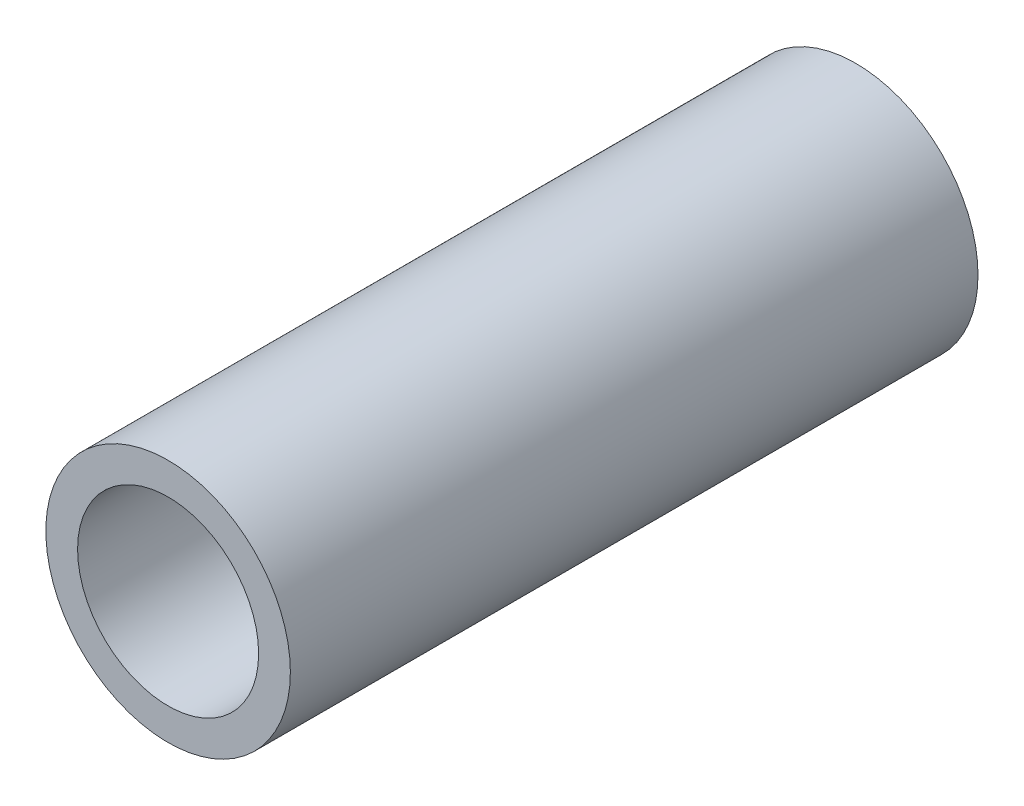
ISO-10303-21;
HEADER;
FILE_DESCRIPTION(('STEP AP214'),'2;1');
FILE_NAME('part.step','',(''),(''),'','','');
FILE_SCHEMA(('AUTOMOTIVE_DESIGN { 1 0 10303 214 1 1 1 1 }'));
ENDSEC;
DATA;
#1=APPLICATION_CONTEXT('core data for automotive mechanical design processes');
#2=APPLICATION_PROTOCOL_DEFINITION('international standard','automotive_design',2000,#1);
#3=PRODUCT_CONTEXT('',#1,'mechanical');
#4=PRODUCT('Part','Part','',(#3));
#5=PRODUCT_RELATED_PRODUCT_CATEGORY('part','',(#4));
#6=PRODUCT_DEFINITION_FORMATION('','',#4);
#7=PRODUCT_DEFINITION_CONTEXT('part definition',#1,'design');
#8=PRODUCT_DEFINITION('design','',#6,#7);
#9=PRODUCT_DEFINITION_SHAPE('','',#8);
#10=(LENGTH_UNIT() NAMED_UNIT(*) SI_UNIT(.MILLI.,.METRE.));
#11=(NAMED_UNIT(*) PLANE_ANGLE_UNIT() SI_UNIT($,.RADIAN.));
#12=(NAMED_UNIT(*) SI_UNIT($,.STERADIAN.) SOLID_ANGLE_UNIT());
#13=UNCERTAINTY_MEASURE_WITH_UNIT(LENGTH_MEASURE(1.E-05),#10,'distance_accuracy_value','');
#14=(GEOMETRIC_REPRESENTATION_CONTEXT(3) GLOBAL_UNCERTAINTY_ASSIGNED_CONTEXT((#13)) GLOBAL_UNIT_ASSIGNED_CONTEXT((#10,
#11,#12)) REPRESENTATION_CONTEXT('',''));
#15=CARTESIAN_POINT('',(0.,0.,0.));
#16=DIRECTION('',(0.,0.,1.));
#17=DIRECTION('',(1.,0.,0.));
#18=AXIS2_PLACEMENT_3D('',#15,#16,#17);
#19=CARTESIAN_POINT('',(0.,0.,30.));
#20=DIRECTION('',(0.,0.,1.));
#21=DIRECTION('',(1.,0.,0.));
#22=AXIS2_PLACEMENT_3D('',#19,#20,#21);
#23=PLANE('',#22);
#24=CARTESIAN_POINT('',(0.,0.,30.));
#25=DIRECTION('',(0.,0.,1.));
#26=DIRECTION('',(1.,0.,0.));
#27=AXIS2_PLACEMENT_3D('',#24,#25,#26);
#28=CIRCLE('',#27,10.668);
#29=CARTESIAN_POINT('',(10.668,0.,30.));
#30=VERTEX_POINT('',#29);
#31=EDGE_CURVE('E11',#30,#30,#28,.T.);
#32=ORIENTED_EDGE('',*,*,#31,.T.);
#33=EDGE_LOOP('',(#32));
#34=FACE_BOUND('',#33,.T.);
#35=CARTESIAN_POINT('',(0.,0.,30.));
#36=DIRECTION('',(0.,0.,1.));
#37=DIRECTION('',(1.,0.,0.));
#38=AXIS2_PLACEMENT_3D('',#35,#36,#37);
#39=CIRCLE('',#38,7.8994);
#40=CARTESIAN_POINT('',(7.8994,0.,30.));
#41=VERTEX_POINT('',#40);
#42=EDGE_CURVE('E48',#41,#41,#39,.T.);
#43=ORIENTED_EDGE('',*,*,#42,.F.);
#44=EDGE_LOOP('',(#43));
#45=FACE_BOUND('',#44,.T.);
#46=ADVANCED_FACE('F37',(#34,#45),#23,.T.);
#47=CARTESIAN_POINT('',(0.,0.,-30.));
#48=DIRECTION('',(0.,0.,1.));
#49=DIRECTION('',(1.,0.,0.));
#50=AXIS2_PLACEMENT_3D('',#47,#48,#49);
#51=PLANE('',#50);
#52=CARTESIAN_POINT('',(0.,0.,-30.));
#53=DIRECTION('',(0.,0.,1.));
#54=DIRECTION('',(1.,0.,0.));
#55=AXIS2_PLACEMENT_3D('',#52,#53,#54);
#56=CIRCLE('',#55,10.668);
#57=CARTESIAN_POINT('',(10.668,0.,-30.));
#58=VERTEX_POINT('',#57);
#59=EDGE_CURVE('E41',#58,#58,#56,.T.);
#60=ORIENTED_EDGE('',*,*,#59,.F.);
#61=EDGE_LOOP('',(#60));
#62=FACE_BOUND('',#61,.T.);
#63=CARTESIAN_POINT('',(0.,0.,-30.));
#64=DIRECTION('',(0.,0.,1.));
#65=DIRECTION('',(1.,0.,0.));
#66=AXIS2_PLACEMENT_3D('',#63,#64,#65);
#67=CIRCLE('',#66,7.8994);
#68=CARTESIAN_POINT('',(7.8994,0.,-30.));
#69=VERTEX_POINT('',#68);
#70=EDGE_CURVE('E50',#69,#69,#67,.T.);
#71=ORIENTED_EDGE('',*,*,#70,.T.);
#72=EDGE_LOOP('',(#71));
#73=FACE_BOUND('',#72,.T.);
#74=ADVANCED_FACE('F60',(#62,#73),#51,.F.);
#75=CARTESIAN_POINT('',(0.,0.,30.));
#76=DIRECTION('',(0.,0.,-1.));
#77=DIRECTION('',(-1.,0.,0.));
#78=AXIS2_PLACEMENT_3D('',#75,#76,#77);
#79=CYLINDRICAL_SURFACE('',#78,10.668);
#80=ORIENTED_EDGE('',*,*,#31,.F.);
#81=EDGE_LOOP('',(#80));
#82=FACE_BOUND('',#81,.T.);
#83=ORIENTED_EDGE('',*,*,#59,.T.);
#84=EDGE_LOOP('',(#83));
#85=FACE_BOUND('',#84,.T.);
#86=ADVANCED_FACE('F39',(#82,#85),#79,.T.);
#87=CARTESIAN_POINT('',(0.,0.,30.));
#88=DIRECTION('',(0.,0.,-1.));
#89=DIRECTION('',(-1.,0.,0.));
#90=AXIS2_PLACEMENT_3D('',#87,#88,#89);
#91=CYLINDRICAL_SURFACE('',#90,7.8994);
#92=ORIENTED_EDGE('',*,*,#42,.T.);
#93=EDGE_LOOP('',(#92));
#94=FACE_BOUND('',#93,.T.);
#95=ORIENTED_EDGE('',*,*,#70,.F.);
#96=EDGE_LOOP('',(#95));
#97=FACE_BOUND('',#96,.T.);
#98=ADVANCED_FACE('F56',(#94,#97),#91,.F.);
#99=CLOSED_SHELL('',(#46,#74,#86,#98));
#100=MANIFOLD_SOLID_BREP('B2',#99);
#101=ADVANCED_BREP_SHAPE_REPRESENTATION('',(#18,#100),#14);
#102=SHAPE_DEFINITION_REPRESENTATION(#9,#101);
ENDSEC;
END-ISO-10303-21;
